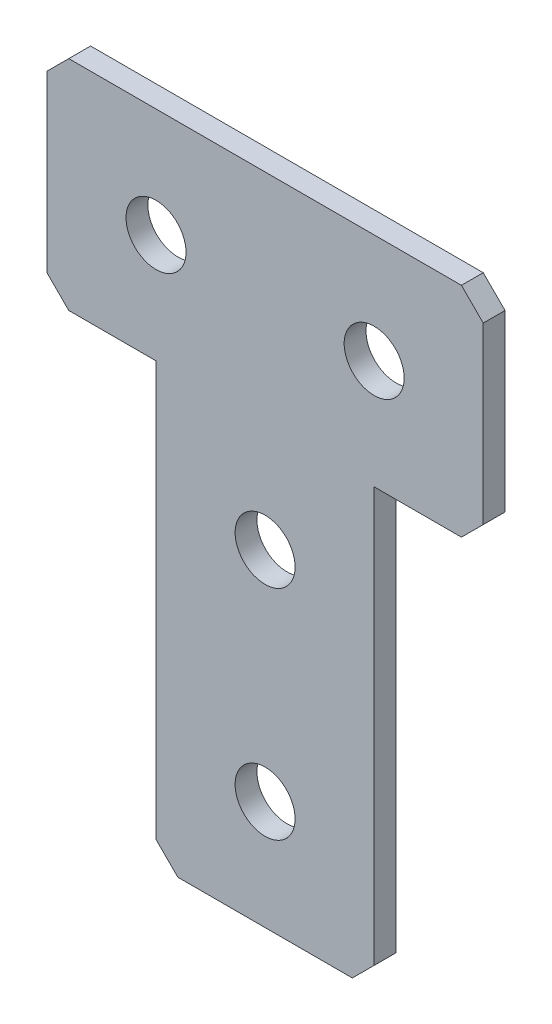
ISO-10303-21;
HEADER;
FILE_DESCRIPTION(('STEP AP214'),'2;1');
FILE_NAME('part.step','',(''),(''),'','','');
FILE_SCHEMA(('AUTOMOTIVE_DESIGN { 1 0 10303 214 1 1 1 1 }'));
ENDSEC;
DATA;
#1=APPLICATION_CONTEXT('core data for automotive mechanical design processes');
#2=APPLICATION_PROTOCOL_DEFINITION('international standard','automotive_design',2000,#1);
#3=PRODUCT_CONTEXT('',#1,'mechanical');
#4=PRODUCT('Part','Part','',(#3));
#5=PRODUCT_RELATED_PRODUCT_CATEGORY('part','',(#4));
#6=PRODUCT_DEFINITION_FORMATION('','',#4);
#7=PRODUCT_DEFINITION_CONTEXT('part definition',#1,'design');
#8=PRODUCT_DEFINITION('design','',#6,#7);
#9=PRODUCT_DEFINITION_SHAPE('','',#8);
#10=(LENGTH_UNIT() NAMED_UNIT(*) SI_UNIT(.MILLI.,.METRE.));
#11=(NAMED_UNIT(*) PLANE_ANGLE_UNIT() SI_UNIT($,.RADIAN.));
#12=(NAMED_UNIT(*) SI_UNIT($,.STERADIAN.) SOLID_ANGLE_UNIT());
#13=UNCERTAINTY_MEASURE_WITH_UNIT(LENGTH_MEASURE(1.E-05),#10,'distance_accuracy_value','');
#14=(GEOMETRIC_REPRESENTATION_CONTEXT(3) GLOBAL_UNCERTAINTY_ASSIGNED_CONTEXT((#13)) GLOBAL_UNIT_ASSIGNED_CONTEXT((#10,
#11,#12)) REPRESENTATION_CONTEXT('',''));
#15=CARTESIAN_POINT('',(0.,0.,0.));
#16=DIRECTION('',(0.,0.,1.));
#17=DIRECTION('',(1.,0.,0.));
#18=AXIS2_PLACEMENT_3D('',#15,#16,#17);
#19=CARTESIAN_POINT('',(-10.,40.,-2.));
#20=DIRECTION('',(1.,0.,0.));
#21=DIRECTION('',(0.,1.,0.));
#22=AXIS2_PLACEMENT_3D('',#19,#20,#21);
#23=PLANE('',#22);
#24=DIRECTION('',(0.,1.,0.));
#25=VECTOR('',#24,1.);
#26=CARTESIAN_POINT('',(-10.,40.,-2.));
#27=LINE('',#26,#25);
#28=CARTESIAN_POINT('',(-10.,1.99999999999999,-2.));
#29=VERTEX_POINT('',#28);
#30=CARTESIAN_POINT('',(-10.,40.,-2.));
#31=VERTEX_POINT('',#30);
#32=EDGE_CURVE('E138',#29,#31,#27,.T.);
#33=ORIENTED_EDGE('',*,*,#32,.F.);
#34=DIRECTION('',(0.,0.,1.));
#35=VECTOR('',#34,1.);
#36=CARTESIAN_POINT('',(-10.,1.99999999999999,-2.));
#37=LINE('',#36,#35);
#38=CARTESIAN_POINT('',(-10.,1.99999999999999,0.));
#39=VERTEX_POINT('',#38);
#40=EDGE_CURVE('E201',#29,#39,#37,.T.);
#41=ORIENTED_EDGE('',*,*,#40,.T.);
#42=DIRECTION('',(0.,1.,0.));
#43=VECTOR('',#42,1.);
#44=CARTESIAN_POINT('',(-10.,40.,0.));
#45=LINE('',#44,#43);
#46=CARTESIAN_POINT('',(-10.,40.,0.));
#47=VERTEX_POINT('',#46);
#48=EDGE_CURVE('E163',#39,#47,#45,.T.);
#49=ORIENTED_EDGE('',*,*,#48,.T.);
#50=DIRECTION('',(0.,0.,1.));
#51=VECTOR('',#50,1.);
#52=CARTESIAN_POINT('',(-10.,40.,-2.));
#53=LINE('',#52,#51);
#54=EDGE_CURVE('E157',#31,#47,#53,.T.);
#55=ORIENTED_EDGE('',*,*,#54,.F.);
#56=EDGE_LOOP('',(#33,#41,#49,#55));
#57=FACE_BOUND('',#56,.T.);
#58=ADVANCED_FACE('F36',(#57),#23,.F.);
#59=CARTESIAN_POINT('',(-20.,40.,-2.));
#60=DIRECTION('',(0.,1.,0.));
#61=DIRECTION('',(0.,0.,1.));
#62=AXIS2_PLACEMENT_3D('',#59,#60,#61);
#63=PLANE('',#62);
#64=DIRECTION('',(-1.,0.,0.));
#65=VECTOR('',#64,1.);
#66=CARTESIAN_POINT('',(-20.,40.,0.));
#67=LINE('',#66,#65);
#68=CARTESIAN_POINT('',(-18.,40.,0.));
#69=VERTEX_POINT('',#68);
#70=EDGE_CURVE('E246',#47,#69,#67,.T.);
#71=ORIENTED_EDGE('',*,*,#70,.T.);
#72=DIRECTION('',(0.,0.,-1.));
#73=VECTOR('',#72,1.);
#74=CARTESIAN_POINT('',(-18.,40.,-2.));
#75=LINE('',#74,#73);
#76=CARTESIAN_POINT('',(-18.,40.,-2.));
#77=VERTEX_POINT('',#76);
#78=EDGE_CURVE('E159',#69,#77,#75,.T.);
#79=ORIENTED_EDGE('',*,*,#78,.T.);
#80=DIRECTION('',(-1.,0.,0.));
#81=VECTOR('',#80,1.);
#82=CARTESIAN_POINT('',(-20.,40.,-2.));
#83=LINE('',#82,#81);
#84=EDGE_CURVE('E142',#31,#77,#83,.T.);
#85=ORIENTED_EDGE('',*,*,#84,.F.);
#86=ORIENTED_EDGE('',*,*,#54,.T.);
#87=EDGE_LOOP('',(#71,#79,#85,#86));
#88=FACE_BOUND('',#87,.T.);
#89=ADVANCED_FACE('F156',(#88),#63,.F.);
#90=CARTESIAN_POINT('',(-20.,60.,-2.));
#91=DIRECTION('',(1.,0.,0.));
#92=DIRECTION('',(0.,0.,-1.));
#93=AXIS2_PLACEMENT_3D('',#90,#91,#92);
#94=PLANE('',#93);
#95=DIRECTION('',(0.,1.,0.));
#96=VECTOR('',#95,1.);
#97=CARTESIAN_POINT('',(-20.,60.,-2.));
#98=LINE('',#97,#96);
#99=CARTESIAN_POINT('',(-20.,42.,-2.));
#100=VERTEX_POINT('',#99);
#101=CARTESIAN_POINT('',(-20.,58.,-2.));
#102=VERTEX_POINT('',#101);
#103=EDGE_CURVE('E160',#100,#102,#98,.T.);
#104=ORIENTED_EDGE('',*,*,#103,.F.);
#105=DIRECTION('',(0.,0.,1.));
#106=VECTOR('',#105,1.);
#107=CARTESIAN_POINT('',(-20.,42.,-2.));
#108=LINE('',#107,#106);
#109=CARTESIAN_POINT('',(-20.,42.,0.));
#110=VERTEX_POINT('',#109);
#111=EDGE_CURVE('E205',#100,#110,#108,.T.);
#112=ORIENTED_EDGE('',*,*,#111,.T.);
#113=DIRECTION('',(0.,1.,0.));
#114=VECTOR('',#113,1.);
#115=CARTESIAN_POINT('',(-20.,60.,0.));
#116=LINE('',#115,#114);
#117=CARTESIAN_POINT('',(-20.,58.,0.));
#118=VERTEX_POINT('',#117);
#119=EDGE_CURVE('E233',#110,#118,#116,.T.);
#120=ORIENTED_EDGE('',*,*,#119,.T.);
#121=DIRECTION('',(0.,0.,-1.));
#122=VECTOR('',#121,1.);
#123=CARTESIAN_POINT('',(-20.,58.,-2.));
#124=LINE('',#123,#122);
#125=EDGE_CURVE('E203',#118,#102,#124,.T.);
#126=ORIENTED_EDGE('',*,*,#125,.T.);
#127=EDGE_LOOP('',(#104,#112,#120,#126));
#128=FACE_BOUND('',#127,.T.);
#129=ADVANCED_FACE('F260',(#128),#94,.F.);
#130=CARTESIAN_POINT('',(-20.,60.,-2.));
#131=DIRECTION('',(0.,-1.,0.));
#132=DIRECTION('',(0.,0.,-1.));
#133=AXIS2_PLACEMENT_3D('',#130,#131,#132);
#134=PLANE('',#133);
#135=DIRECTION('',(1.,0.,0.));
#136=VECTOR('',#135,1.);
#137=CARTESIAN_POINT('',(-20.,60.,-2.));
#138=LINE('',#137,#136);
#139=CARTESIAN_POINT('',(-18.,60.,-2.));
#140=VERTEX_POINT('',#139);
#141=CARTESIAN_POINT('',(18.,60.,-2.));
#142=VERTEX_POINT('',#141);
#143=EDGE_CURVE('E269',#140,#142,#138,.T.);
#144=ORIENTED_EDGE('',*,*,#143,.F.);
#145=DIRECTION('',(0.,0.,1.));
#146=VECTOR('',#145,1.);
#147=CARTESIAN_POINT('',(-18.,60.,-2.));
#148=LINE('',#147,#146);
#149=CARTESIAN_POINT('',(-18.,60.,0.));
#150=VERTEX_POINT('',#149);
#151=EDGE_CURVE('E211',#140,#150,#148,.T.);
#152=ORIENTED_EDGE('',*,*,#151,.T.);
#153=DIRECTION('',(1.,0.,0.));
#154=VECTOR('',#153,1.);
#155=CARTESIAN_POINT('',(-20.,60.,0.));
#156=LINE('',#155,#154);
#157=CARTESIAN_POINT('',(18.,60.,0.));
#158=VERTEX_POINT('',#157);
#159=EDGE_CURVE('E229',#150,#158,#156,.T.);
#160=ORIENTED_EDGE('',*,*,#159,.T.);
#161=DIRECTION('',(0.,0.,-1.));
#162=VECTOR('',#161,1.);
#163=CARTESIAN_POINT('',(18.,60.,-2.));
#164=LINE('',#163,#162);
#165=EDGE_CURVE('E209',#158,#142,#164,.T.);
#166=ORIENTED_EDGE('',*,*,#165,.T.);
#167=EDGE_LOOP('',(#144,#152,#160,#166));
#168=FACE_BOUND('',#167,.T.);
#169=ADVANCED_FACE('F271',(#168),#134,.F.);
#170=CARTESIAN_POINT('',(20.,60.,-2.));
#171=DIRECTION('',(-1.,0.,0.));
#172=DIRECTION('',(0.,0.,1.));
#173=AXIS2_PLACEMENT_3D('',#170,#171,#172);
#174=PLANE('',#173);
#175=DIRECTION('',(0.,-1.,0.));
#176=VECTOR('',#175,1.);
#177=CARTESIAN_POINT('',(20.,60.,-2.));
#178=LINE('',#177,#176);
#179=CARTESIAN_POINT('',(20.,58.,-2.));
#180=VERTEX_POINT('',#179);
#181=CARTESIAN_POINT('',(20.,42.,-2.));
#182=VERTEX_POINT('',#181);
#183=EDGE_CURVE('E219',#180,#182,#178,.T.);
#184=ORIENTED_EDGE('',*,*,#183,.F.);
#185=DIRECTION('',(0.,0.,1.));
#186=VECTOR('',#185,1.);
#187=CARTESIAN_POINT('',(20.,58.,-2.));
#188=LINE('',#187,#186);
#189=CARTESIAN_POINT('',(20.,58.,0.));
#190=VERTEX_POINT('',#189);
#191=EDGE_CURVE('E44',#180,#190,#188,.T.);
#192=ORIENTED_EDGE('',*,*,#191,.T.);
#193=DIRECTION('',(0.,-1.,0.));
#194=VECTOR('',#193,1.);
#195=CARTESIAN_POINT('',(20.,60.,0.));
#196=LINE('',#195,#194);
#197=CARTESIAN_POINT('',(20.,42.,0.));
#198=VERTEX_POINT('',#197);
#199=EDGE_CURVE('E218',#190,#198,#196,.T.);
#200=ORIENTED_EDGE('',*,*,#199,.T.);
#201=DIRECTION('',(0.,0.,-1.));
#202=VECTOR('',#201,1.);
#203=CARTESIAN_POINT('',(20.,42.,-2.));
#204=LINE('',#203,#202);
#205=EDGE_CURVE('E59',#198,#182,#204,.T.);
#206=ORIENTED_EDGE('',*,*,#205,.T.);
#207=EDGE_LOOP('',(#184,#192,#200,#206));
#208=FACE_BOUND('',#207,.T.);
#209=ADVANCED_FACE('F217',(#208),#174,.F.);
#210=CARTESIAN_POINT('',(20.,40.,-2.));
#211=DIRECTION('',(0.,1.,0.));
#212=DIRECTION('',(0.,0.,1.));
#213=AXIS2_PLACEMENT_3D('',#210,#211,#212);
#214=PLANE('',#213);
#215=DIRECTION('',(-1.,0.,0.));
#216=VECTOR('',#215,1.);
#217=CARTESIAN_POINT('',(20.,40.,-2.));
#218=LINE('',#217,#216);
#219=CARTESIAN_POINT('',(18.,40.,-2.));
#220=VERTEX_POINT('',#219);
#221=CARTESIAN_POINT('',(10.,40.,-2.));
#222=VERTEX_POINT('',#221);
#223=EDGE_CURVE('E274',#220,#222,#218,.T.);
#224=ORIENTED_EDGE('',*,*,#223,.F.);
#225=DIRECTION('',(0.,0.,1.));
#226=VECTOR('',#225,1.);
#227=CARTESIAN_POINT('',(18.,40.,-2.));
#228=LINE('',#227,#226);
#229=CARTESIAN_POINT('',(18.,40.,0.));
#230=VERTEX_POINT('',#229);
#231=EDGE_CURVE('E11',#220,#230,#228,.T.);
#232=ORIENTED_EDGE('',*,*,#231,.T.);
#233=DIRECTION('',(-1.,0.,0.));
#234=VECTOR('',#233,1.);
#235=CARTESIAN_POINT('',(20.,40.,0.));
#236=LINE('',#235,#234);
#237=CARTESIAN_POINT('',(10.,40.,0.));
#238=VERTEX_POINT('',#237);
#239=EDGE_CURVE('E228',#230,#238,#236,.T.);
#240=ORIENTED_EDGE('',*,*,#239,.T.);
#241=DIRECTION('',(0.,0.,1.));
#242=VECTOR('',#241,1.);
#243=CARTESIAN_POINT('',(10.,40.,-2.));
#244=LINE('',#243,#242);
#245=EDGE_CURVE('E166',#222,#238,#244,.T.);
#246=ORIENTED_EDGE('',*,*,#245,.F.);
#247=EDGE_LOOP('',(#224,#232,#240,#246));
#248=FACE_BOUND('',#247,.T.);
#249=ADVANCED_FACE('F289',(#248),#214,.F.);
#250=CARTESIAN_POINT('',(10.,40.,-2.));
#251=DIRECTION('',(-1.,0.,0.));
#252=DIRECTION('',(0.,-1.,0.));
#253=AXIS2_PLACEMENT_3D('',#250,#251,#252);
#254=PLANE('',#253);
#255=DIRECTION('',(0.,-1.,0.));
#256=VECTOR('',#255,1.);
#257=CARTESIAN_POINT('',(10.,40.,0.));
#258=LINE('',#257,#256);
#259=CARTESIAN_POINT('',(10.,2.00000000000001,0.));
#260=VERTEX_POINT('',#259);
#261=EDGE_CURVE('E231',#238,#260,#258,.T.);
#262=ORIENTED_EDGE('',*,*,#261,.T.);
#263=DIRECTION('',(0.,0.,-1.));
#264=VECTOR('',#263,1.);
#265=CARTESIAN_POINT('',(10.,2.00000000000001,-2.));
#266=LINE('',#265,#264);
#267=CARTESIAN_POINT('',(10.,2.00000000000001,-2.));
#268=VERTEX_POINT('',#267);
#269=EDGE_CURVE('E189',#260,#268,#266,.T.);
#270=ORIENTED_EDGE('',*,*,#269,.T.);
#271=DIRECTION('',(0.,-1.,0.));
#272=VECTOR('',#271,1.);
#273=CARTESIAN_POINT('',(10.,40.,-2.));
#274=LINE('',#273,#272);
#275=EDGE_CURVE('E278',#222,#268,#274,.T.);
#276=ORIENTED_EDGE('',*,*,#275,.F.);
#277=ORIENTED_EDGE('',*,*,#245,.T.);
#278=EDGE_LOOP('',(#262,#270,#276,#277));
#279=FACE_BOUND('',#278,.T.);
#280=ADVANCED_FACE('F286',(#279),#254,.F.);
#281=CARTESIAN_POINT('',(10.,0.,-2.));
#282=DIRECTION('',(0.,1.,0.));
#283=DIRECTION('',(0.,0.,1.));
#284=AXIS2_PLACEMENT_3D('',#281,#282,#283);
#285=PLANE('',#284);
#286=DIRECTION('',(-1.,0.,0.));
#287=VECTOR('',#286,1.);
#288=CARTESIAN_POINT('',(10.,0.,-2.));
#289=LINE('',#288,#287);
#290=CARTESIAN_POINT('',(8.00000000000001,0.,-2.));
#291=VERTEX_POINT('',#290);
#292=CARTESIAN_POINT('',(-7.99999999999999,0.,-2.));
#293=VERTEX_POINT('',#292);
#294=EDGE_CURVE('E171',#291,#293,#289,.T.);
#295=ORIENTED_EDGE('',*,*,#294,.F.);
#296=DIRECTION('',(0.,0.,1.));
#297=VECTOR('',#296,1.);
#298=CARTESIAN_POINT('',(8.00000000000001,0.,-2.));
#299=LINE('',#298,#297);
#300=CARTESIAN_POINT('',(8.00000000000001,0.,0.));
#301=VERTEX_POINT('',#300);
#302=EDGE_CURVE('E168',#291,#301,#299,.T.);
#303=ORIENTED_EDGE('',*,*,#302,.T.);
#304=DIRECTION('',(-1.,0.,0.));
#305=VECTOR('',#304,1.);
#306=CARTESIAN_POINT('',(10.,0.,0.));
#307=LINE('',#306,#305);
#308=CARTESIAN_POINT('',(-7.99999999999999,0.,0.));
#309=VERTEX_POINT('',#308);
#310=EDGE_CURVE('E151',#301,#309,#307,.T.);
#311=ORIENTED_EDGE('',*,*,#310,.T.);
#312=DIRECTION('',(0.,0.,-1.));
#313=VECTOR('',#312,1.);
#314=CARTESIAN_POINT('',(-7.99999999999999,0.,-2.));
#315=LINE('',#314,#313);
#316=EDGE_CURVE('E165',#309,#293,#315,.T.);
#317=ORIENTED_EDGE('',*,*,#316,.T.);
#318=EDGE_LOOP('',(#295,#303,#311,#317));
#319=FACE_BOUND('',#318,.T.);
#320=ADVANCED_FACE('F242',(#319),#285,.F.);
#321=CARTESIAN_POINT('',(0.,0.,-2.));
#322=DIRECTION('',(0.,0.,-1.));
#323=DIRECTION('',(-1.,0.,0.));
#324=AXIS2_PLACEMENT_3D('',#321,#322,#323);
#325=PLANE('',#324);
#326=CARTESIAN_POINT('',(-10.,50.,-2.));
#327=DIRECTION('',(0.,0.,1.));
#328=DIRECTION('',(1.,0.,0.));
#329=AXIS2_PLACEMENT_3D('',#326,#327,#328);
#330=CIRCLE('',#329,2.74999999999999);
#331=CARTESIAN_POINT('',(-7.25000000000001,50.,-2.));
#332=VERTEX_POINT('',#331);
#333=EDGE_CURVE('E466',#332,#332,#330,.T.);
#334=ORIENTED_EDGE('',*,*,#333,.T.);
#335=EDGE_LOOP('',(#334));
#336=FACE_BOUND('',#335,.T.);
#337=CARTESIAN_POINT('',(10.,50.,-2.));
#338=DIRECTION('',(0.,0.,1.));
#339=DIRECTION('',(1.,0.,0.));
#340=AXIS2_PLACEMENT_3D('',#337,#338,#339);
#341=CIRCLE('',#340,2.74999999999999);
#342=CARTESIAN_POINT('',(12.75,50.,-2.));
#343=VERTEX_POINT('',#342);
#344=EDGE_CURVE('E476',#343,#343,#341,.T.);
#345=ORIENTED_EDGE('',*,*,#344,.T.);
#346=EDGE_LOOP('',(#345));
#347=FACE_BOUND('',#346,.T.);
#348=CARTESIAN_POINT('',(0.,30.,-2.));
#349=DIRECTION('',(0.,0.,1.));
#350=DIRECTION('',(1.,0.,0.));
#351=AXIS2_PLACEMENT_3D('',#348,#349,#350);
#352=CIRCLE('',#351,2.74999999999999);
#353=CARTESIAN_POINT('',(2.74999999999999,30.,-2.));
#354=VERTEX_POINT('',#353);
#355=EDGE_CURVE('E482',#354,#354,#352,.T.);
#356=ORIENTED_EDGE('',*,*,#355,.T.);
#357=EDGE_LOOP('',(#356));
#358=FACE_BOUND('',#357,.T.);
#359=CARTESIAN_POINT('',(0.,10.,-2.));
#360=DIRECTION('',(0.,0.,1.));
#361=DIRECTION('',(1.,0.,0.));
#362=AXIS2_PLACEMENT_3D('',#359,#360,#361);
#363=CIRCLE('',#362,2.74999999999999);
#364=CARTESIAN_POINT('',(2.74999999999999,10.,-2.));
#365=VERTEX_POINT('',#364);
#366=EDGE_CURVE('E247',#365,#365,#363,.T.);
#367=ORIENTED_EDGE('',*,*,#366,.T.);
#368=EDGE_LOOP('',(#367));
#369=FACE_BOUND('',#368,.T.);
#370=ORIENTED_EDGE('',*,*,#275,.T.);
#371=DIRECTION('',(0.707106781186545,0.70710678118655,0.));
#372=VECTOR('',#371,1.);
#373=CARTESIAN_POINT('',(4.00000000000002,-4.,-2.));
#374=LINE('',#373,#372);
#375=EDGE_CURVE('E199',#268,#291,#374,.F.);
#376=ORIENTED_EDGE('',*,*,#375,.T.);
#377=ORIENTED_EDGE('',*,*,#294,.T.);
#378=DIRECTION('',(0.707106781186551,-0.707106781186544,0.));
#379=VECTOR('',#378,1.);
#380=CARTESIAN_POINT('',(-3.99999999999995,-3.99999999999999,-2.));
#381=LINE('',#380,#379);
#382=EDGE_CURVE('E146',#293,#29,#381,.F.);
#383=ORIENTED_EDGE('',*,*,#382,.T.);
#384=ORIENTED_EDGE('',*,*,#32,.T.);
#385=ORIENTED_EDGE('',*,*,#84,.T.);
#386=DIRECTION('',(0.70710678118655,-0.707106781186545,0.));
#387=VECTOR('',#386,1.);
#388=CARTESIAN_POINT('',(11.0000000000001,11.0000000000001,-2.));
#389=LINE('',#388,#387);
#390=EDGE_CURVE('E196',#77,#100,#389,.F.);
#391=ORIENTED_EDGE('',*,*,#390,.T.);
#392=ORIENTED_EDGE('',*,*,#103,.T.);
#393=DIRECTION('',(-0.707106781186545,-0.70710678118655,0.));
#394=VECTOR('',#393,1.);
#395=CARTESIAN_POINT('',(-39.0000000000001,38.9999999999998,-2.));
#396=LINE('',#395,#394);
#397=EDGE_CURVE('E194',#102,#140,#396,.F.);
#398=ORIENTED_EDGE('',*,*,#397,.T.);
#399=ORIENTED_EDGE('',*,*,#143,.T.);
#400=DIRECTION('',(-0.70710678118655,0.707106781186545,0.));
#401=VECTOR('',#400,1.);
#402=CARTESIAN_POINT('',(38.9999999999999,39.0000000000002,-2.));
#403=LINE('',#402,#401);
#404=EDGE_CURVE('E192',#142,#180,#403,.F.);
#405=ORIENTED_EDGE('',*,*,#404,.T.);
#406=ORIENTED_EDGE('',*,*,#183,.T.);
#407=DIRECTION('',(0.707106781186546,0.707106781186549,0.));
#408=VECTOR('',#407,1.);
#409=CARTESIAN_POINT('',(-11.,10.9999999999999,-2.));
#410=LINE('',#409,#408);
#411=EDGE_CURVE('E51',#182,#220,#410,.F.);
#412=ORIENTED_EDGE('',*,*,#411,.T.);
#413=ORIENTED_EDGE('',*,*,#223,.T.);
#414=EDGE_LOOP('',(#370,#376,#377,#383,#384,#385,#391,#392,#398,#399,#405,#406,#412,#413));
#415=FACE_BOUND('',#414,.T.);
#416=ADVANCED_FACE('F141',(#336,#347,#358,#369,#415),#325,.T.);
#417=CARTESIAN_POINT('',(0.,0.,0.));
#418=DIRECTION('',(0.,0.,-1.));
#419=DIRECTION('',(-1.,0.,0.));
#420=AXIS2_PLACEMENT_3D('',#417,#418,#419);
#421=PLANE('',#420);
#422=CARTESIAN_POINT('',(-10.,50.,0.));
#423=DIRECTION('',(0.,0.,1.));
#424=DIRECTION('',(1.,0.,0.));
#425=AXIS2_PLACEMENT_3D('',#422,#423,#424);
#426=CIRCLE('',#425,2.74999999999999);
#427=CARTESIAN_POINT('',(-7.25000000000001,50.,0.));
#428=VERTEX_POINT('',#427);
#429=EDGE_CURVE('E469',#428,#428,#426,.T.);
#430=ORIENTED_EDGE('',*,*,#429,.F.);
#431=EDGE_LOOP('',(#430));
#432=FACE_BOUND('',#431,.T.);
#433=CARTESIAN_POINT('',(10.,50.,0.));
#434=DIRECTION('',(0.,0.,1.));
#435=DIRECTION('',(1.,0.,0.));
#436=AXIS2_PLACEMENT_3D('',#433,#434,#435);
#437=CIRCLE('',#436,2.74999999999999);
#438=CARTESIAN_POINT('',(12.75,50.,0.));
#439=VERTEX_POINT('',#438);
#440=EDGE_CURVE('E471',#439,#439,#437,.T.);
#441=ORIENTED_EDGE('',*,*,#440,.F.);
#442=EDGE_LOOP('',(#441));
#443=FACE_BOUND('',#442,.T.);
#444=CARTESIAN_POINT('',(0.,30.,0.));
#445=DIRECTION('',(0.,0.,1.));
#446=DIRECTION('',(1.,0.,0.));
#447=AXIS2_PLACEMENT_3D('',#444,#445,#446);
#448=CIRCLE('',#447,2.74999999999999);
#449=CARTESIAN_POINT('',(2.74999999999999,30.,0.));
#450=VERTEX_POINT('',#449);
#451=EDGE_CURVE('E479',#450,#450,#448,.T.);
#452=ORIENTED_EDGE('',*,*,#451,.F.);
#453=EDGE_LOOP('',(#452));
#454=FACE_BOUND('',#453,.T.);
#455=CARTESIAN_POINT('',(0.,10.,0.));
#456=DIRECTION('',(0.,0.,1.));
#457=DIRECTION('',(1.,0.,0.));
#458=AXIS2_PLACEMENT_3D('',#455,#456,#457);
#459=CIRCLE('',#458,2.74999999999999);
#460=CARTESIAN_POINT('',(2.74999999999999,10.,0.));
#461=VERTEX_POINT('',#460);
#462=EDGE_CURVE('E251',#461,#461,#459,.T.);
#463=ORIENTED_EDGE('',*,*,#462,.F.);
#464=EDGE_LOOP('',(#463));
#465=FACE_BOUND('',#464,.T.);
#466=ORIENTED_EDGE('',*,*,#310,.F.);
#467=DIRECTION('',(-0.707106781186545,-0.70710678118655,0.));
#468=VECTOR('',#467,1.);
#469=CARTESIAN_POINT('',(8.00000000000001,0.,0.));
#470=LINE('',#469,#468);
#471=EDGE_CURVE('E187',#301,#260,#470,.F.);
#472=ORIENTED_EDGE('',*,*,#471,.T.);
#473=ORIENTED_EDGE('',*,*,#261,.F.);
#474=ORIENTED_EDGE('',*,*,#239,.F.);
#475=DIRECTION('',(-0.707106781186546,-0.707106781186549,0.));
#476=VECTOR('',#475,1.);
#477=CARTESIAN_POINT('',(18.,40.,0.));
#478=LINE('',#477,#476);
#479=EDGE_CURVE('E177',#230,#198,#478,.F.);
#480=ORIENTED_EDGE('',*,*,#479,.T.);
#481=ORIENTED_EDGE('',*,*,#199,.F.);
#482=DIRECTION('',(0.70710678118655,-0.707106781186545,0.));
#483=VECTOR('',#482,1.);
#484=CARTESIAN_POINT('',(20.,58.,0.));
#485=LINE('',#484,#483);
#486=EDGE_CURVE('E179',#190,#158,#485,.F.);
#487=ORIENTED_EDGE('',*,*,#486,.T.);
#488=ORIENTED_EDGE('',*,*,#159,.F.);
#489=DIRECTION('',(0.707106781186545,0.70710678118655,0.));
#490=VECTOR('',#489,1.);
#491=CARTESIAN_POINT('',(-18.,60.,0.));
#492=LINE('',#491,#490);
#493=EDGE_CURVE('E181',#150,#118,#492,.F.);
#494=ORIENTED_EDGE('',*,*,#493,.T.);
#495=ORIENTED_EDGE('',*,*,#119,.F.);
#496=DIRECTION('',(-0.70710678118655,0.707106781186545,0.));
#497=VECTOR('',#496,1.);
#498=CARTESIAN_POINT('',(-20.,42.,0.));
#499=LINE('',#498,#497);
#500=EDGE_CURVE('E183',#110,#69,#499,.F.);
#501=ORIENTED_EDGE('',*,*,#500,.T.);
#502=ORIENTED_EDGE('',*,*,#70,.F.);
#503=ORIENTED_EDGE('',*,*,#48,.F.);
#504=DIRECTION('',(-0.707106781186551,0.707106781186544,0.));
#505=VECTOR('',#504,1.);
#506=CARTESIAN_POINT('',(-10.,1.99999999999999,0.));
#507=LINE('',#506,#505);
#508=EDGE_CURVE('E185',#39,#309,#507,.F.);
#509=ORIENTED_EDGE('',*,*,#508,.T.);
#510=EDGE_LOOP('',(#466,#472,#473,#474,#480,#481,#487,#488,#494,#495,#501,#502,#503,#509));
#511=FACE_BOUND('',#510,.T.);
#512=ADVANCED_FACE('F224',(#432,#443,#454,#465,#511),#421,.F.);
#513=CARTESIAN_POINT('',(8.00000000000001,0.,-2.));
#514=DIRECTION('',(-0.70710678118655,0.707106781186545,0.));
#515=DIRECTION('',(0.,0.,1.));
#516=AXIS2_PLACEMENT_3D('',#513,#514,#515);
#517=PLANE('',#516);
#518=ORIENTED_EDGE('',*,*,#375,.F.);
#519=ORIENTED_EDGE('',*,*,#269,.F.);
#520=ORIENTED_EDGE('',*,*,#471,.F.);
#521=ORIENTED_EDGE('',*,*,#302,.F.);
#522=EDGE_LOOP('',(#518,#519,#520,#521));
#523=FACE_BOUND('',#522,.T.);
#524=ADVANCED_FACE('F282',(#523),#517,.F.);
#525=CARTESIAN_POINT('',(-10.,1.99999999999999,-2.));
#526=DIRECTION('',(0.707106781186544,0.707106781186551,0.));
#527=DIRECTION('',(0.,0.,1.));
#528=AXIS2_PLACEMENT_3D('',#525,#526,#527);
#529=PLANE('',#528);
#530=ORIENTED_EDGE('',*,*,#382,.F.);
#531=ORIENTED_EDGE('',*,*,#316,.F.);
#532=ORIENTED_EDGE('',*,*,#508,.F.);
#533=ORIENTED_EDGE('',*,*,#40,.F.);
#534=EDGE_LOOP('',(#530,#531,#532,#533));
#535=FACE_BOUND('',#534,.T.);
#536=ADVANCED_FACE('F245',(#535),#529,.F.);
#537=CARTESIAN_POINT('',(-20.,42.,-2.));
#538=DIRECTION('',(0.707106781186545,0.70710678118655,0.));
#539=DIRECTION('',(0.,0.,1.));
#540=AXIS2_PLACEMENT_3D('',#537,#538,#539);
#541=PLANE('',#540);
#542=ORIENTED_EDGE('',*,*,#390,.F.);
#543=ORIENTED_EDGE('',*,*,#78,.F.);
#544=ORIENTED_EDGE('',*,*,#500,.F.);
#545=ORIENTED_EDGE('',*,*,#111,.F.);
#546=EDGE_LOOP('',(#542,#543,#544,#545));
#547=FACE_BOUND('',#546,.T.);
#548=ADVANCED_FACE('F314',(#547),#541,.F.);
#549=CARTESIAN_POINT('',(-18.,60.,-2.));
#550=DIRECTION('',(0.70710678118655,-0.707106781186545,0.));
#551=DIRECTION('',(0.,0.,1.));
#552=AXIS2_PLACEMENT_3D('',#549,#550,#551);
#553=PLANE('',#552);
#554=ORIENTED_EDGE('',*,*,#397,.F.);
#555=ORIENTED_EDGE('',*,*,#125,.F.);
#556=ORIENTED_EDGE('',*,*,#493,.F.);
#557=ORIENTED_EDGE('',*,*,#151,.F.);
#558=EDGE_LOOP('',(#554,#555,#556,#557));
#559=FACE_BOUND('',#558,.T.);
#560=ADVANCED_FACE('F265',(#559),#553,.F.);
#561=CARTESIAN_POINT('',(20.,58.,-2.));
#562=DIRECTION('',(-0.707106781186545,-0.70710678118655,0.));
#563=DIRECTION('',(0.,0.,1.));
#564=AXIS2_PLACEMENT_3D('',#561,#562,#563);
#565=PLANE('',#564);
#566=ORIENTED_EDGE('',*,*,#404,.F.);
#567=ORIENTED_EDGE('',*,*,#165,.F.);
#568=ORIENTED_EDGE('',*,*,#486,.F.);
#569=ORIENTED_EDGE('',*,*,#191,.F.);
#570=EDGE_LOOP('',(#566,#567,#568,#569));
#571=FACE_BOUND('',#570,.T.);
#572=ADVANCED_FACE('F294',(#571),#565,.F.);
#573=CARTESIAN_POINT('',(18.,40.,-2.));
#574=DIRECTION('',(-0.707106781186549,0.707106781186546,0.));
#575=DIRECTION('',(0.,0.,1.));
#576=AXIS2_PLACEMENT_3D('',#573,#574,#575);
#577=PLANE('',#576);
#578=ORIENTED_EDGE('',*,*,#411,.F.);
#579=ORIENTED_EDGE('',*,*,#205,.F.);
#580=ORIENTED_EDGE('',*,*,#479,.F.);
#581=ORIENTED_EDGE('',*,*,#231,.F.);
#582=EDGE_LOOP('',(#578,#579,#580,#581));
#583=FACE_BOUND('',#582,.T.);
#584=ADVANCED_FACE('F38',(#583),#577,.F.);
#585=CARTESIAN_POINT('',(0.,10.,0.));
#586=DIRECTION('',(0.,0.,1.));
#587=DIRECTION('',(1.,0.,0.));
#588=AXIS2_PLACEMENT_3D('',#585,#586,#587);
#589=CYLINDRICAL_SURFACE('',#588,2.74999999999999);
#590=ORIENTED_EDGE('',*,*,#366,.F.);
#591=EDGE_LOOP('',(#590));
#592=FACE_BOUND('',#591,.T.);
#593=ORIENTED_EDGE('',*,*,#462,.T.);
#594=EDGE_LOOP('',(#593));
#595=FACE_BOUND('',#594,.T.);
#596=ADVANCED_FACE('F293',(#592,#595),#589,.F.);
#597=CARTESIAN_POINT('',(0.,30.,0.));
#598=DIRECTION('',(0.,0.,1.));
#599=DIRECTION('',(1.,0.,0.));
#600=AXIS2_PLACEMENT_3D('',#597,#598,#599);
#601=CYLINDRICAL_SURFACE('',#600,2.74999999999999);
#602=ORIENTED_EDGE('',*,*,#355,.F.);
#603=EDGE_LOOP('',(#602));
#604=FACE_BOUND('',#603,.T.);
#605=ORIENTED_EDGE('',*,*,#451,.T.);
#606=EDGE_LOOP('',(#605));
#607=FACE_BOUND('',#606,.T.);
#608=ADVANCED_FACE('F299',(#604,#607),#601,.F.);
#609=CARTESIAN_POINT('',(10.,50.,0.));
#610=DIRECTION('',(0.,0.,1.));
#611=DIRECTION('',(1.,0.,0.));
#612=AXIS2_PLACEMENT_3D('',#609,#610,#611);
#613=CYLINDRICAL_SURFACE('',#612,2.74999999999999);
#614=ORIENTED_EDGE('',*,*,#344,.F.);
#615=EDGE_LOOP('',(#614));
#616=FACE_BOUND('',#615,.T.);
#617=ORIENTED_EDGE('',*,*,#440,.T.);
#618=EDGE_LOOP('',(#617));
#619=FACE_BOUND('',#618,.T.);
#620=ADVANCED_FACE('F367',(#616,#619),#613,.F.);
#621=CARTESIAN_POINT('',(-10.,50.,0.));
#622=DIRECTION('',(0.,0.,1.));
#623=DIRECTION('',(1.,0.,0.));
#624=AXIS2_PLACEMENT_3D('',#621,#622,#623);
#625=CYLINDRICAL_SURFACE('',#624,2.74999999999999);
#626=ORIENTED_EDGE('',*,*,#333,.F.);
#627=EDGE_LOOP('',(#626));
#628=FACE_BOUND('',#627,.T.);
#629=ORIENTED_EDGE('',*,*,#429,.T.);
#630=EDGE_LOOP('',(#629));
#631=FACE_BOUND('',#630,.T.);
#632=ADVANCED_FACE('F377',(#628,#631),#625,.F.);
#633=CLOSED_SHELL('',(#58,#89,#129,#169,#209,#249,#280,#320,#416,#512,#524,#536,#548,#560,#572,
#584,#596,#608,#620,#632));
#634=MANIFOLD_SOLID_BREP('B2',#633);
#635=ADVANCED_BREP_SHAPE_REPRESENTATION('',(#18,#634),#14);
#636=SHAPE_DEFINITION_REPRESENTATION(#9,#635);
ENDSEC;
END-ISO-10303-21;
